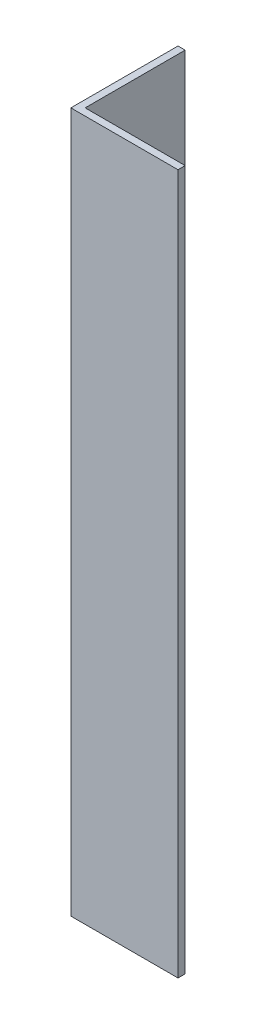
ISO-10303-21;
HEADER;
FILE_DESCRIPTION(('STEP AP214'),'2;1');
FILE_NAME('part.step','',(''),(''),'','','');
FILE_SCHEMA(('AUTOMOTIVE_DESIGN { 1 0 10303 214 1 1 1 1 }'));
ENDSEC;
DATA;
#1=APPLICATION_CONTEXT('core data for automotive mechanical design processes');
#2=APPLICATION_PROTOCOL_DEFINITION('international standard','automotive_design',2000,#1);
#3=PRODUCT_CONTEXT('',#1,'mechanical');
#4=PRODUCT('Part','Part','',(#3));
#5=PRODUCT_RELATED_PRODUCT_CATEGORY('part','',(#4));
#6=PRODUCT_DEFINITION_FORMATION('','',#4);
#7=PRODUCT_DEFINITION_CONTEXT('part definition',#1,'design');
#8=PRODUCT_DEFINITION('design','',#6,#7);
#9=PRODUCT_DEFINITION_SHAPE('','',#8);
#10=(LENGTH_UNIT() NAMED_UNIT(*) SI_UNIT(.MILLI.,.METRE.));
#11=(NAMED_UNIT(*) PLANE_ANGLE_UNIT() SI_UNIT($,.RADIAN.));
#12=(NAMED_UNIT(*) SI_UNIT($,.STERADIAN.) SOLID_ANGLE_UNIT());
#13=UNCERTAINTY_MEASURE_WITH_UNIT(LENGTH_MEASURE(1.E-05),#10,'distance_accuracy_value','');
#14=(GEOMETRIC_REPRESENTATION_CONTEXT(3) GLOBAL_UNCERTAINTY_ASSIGNED_CONTEXT((#13)) GLOBAL_UNIT_ASSIGNED_CONTEXT((#10,
#11,#12)) REPRESENTATION_CONTEXT('',''));
#15=CARTESIAN_POINT('',(0.,0.,0.));
#16=DIRECTION('',(0.,0.,1.));
#17=DIRECTION('',(1.,0.,0.));
#18=AXIS2_PLACEMENT_3D('',#15,#16,#17);
#19=CARTESIAN_POINT('',(15.,98.,0.));
#20=DIRECTION('',(0.,0.,-1.));
#21=DIRECTION('',(-1.,0.,0.));
#22=AXIS2_PLACEMENT_3D('',#19,#20,#21);
#23=PLANE('',#22);
#24=DIRECTION('',(1.,0.,0.));
#25=VECTOR('',#24,1.);
#26=CARTESIAN_POINT('',(15.,0.,0.));
#27=LINE('',#26,#25);
#28=CARTESIAN_POINT('',(0.,0.,0.));
#29=VERTEX_POINT('',#28);
#30=CARTESIAN_POINT('',(15.,0.,0.));
#31=VERTEX_POINT('',#30);
#32=EDGE_CURVE('E121',#29,#31,#27,.T.);
#33=ORIENTED_EDGE('',*,*,#32,.T.);
#34=DIRECTION('',(0.,-1.,0.));
#35=VECTOR('',#34,1.);
#36=CARTESIAN_POINT('',(15.,98.,0.));
#37=LINE('',#36,#35);
#38=CARTESIAN_POINT('',(15.,98.,0.));
#39=VERTEX_POINT('',#38);
#40=EDGE_CURVE('E11',#39,#31,#37,.T.);
#41=ORIENTED_EDGE('',*,*,#40,.F.);
#42=DIRECTION('',(1.,0.,0.));
#43=VECTOR('',#42,1.);
#44=CARTESIAN_POINT('',(15.,98.,0.));
#45=LINE('',#44,#43);
#46=CARTESIAN_POINT('',(0.,98.,0.));
#47=VERTEX_POINT('',#46);
#48=EDGE_CURVE('E131',#47,#39,#45,.T.);
#49=ORIENTED_EDGE('',*,*,#48,.F.);
#50=DIRECTION('',(0.,-1.,0.));
#51=VECTOR('',#50,1.);
#52=CARTESIAN_POINT('',(0.,98.,0.));
#53=LINE('',#52,#51);
#54=EDGE_CURVE('E117',#47,#29,#53,.T.);
#55=ORIENTED_EDGE('',*,*,#54,.T.);
#56=EDGE_LOOP('',(#33,#41,#49,#55));
#57=FACE_BOUND('',#56,.T.);
#58=ADVANCED_FACE('F37',(#57),#23,.F.);
#59=CARTESIAN_POINT('',(15.,98.,-0.999999999999998));
#60=DIRECTION('',(-1.,0.,0.));
#61=DIRECTION('',(0.,0.,1.));
#62=AXIS2_PLACEMENT_3D('',#59,#60,#61);
#63=PLANE('',#62);
#64=DIRECTION('',(0.,0.,-1.));
#65=VECTOR('',#64,1.);
#66=CARTESIAN_POINT('',(15.,0.,-0.999999999999998));
#67=LINE('',#66,#65);
#68=CARTESIAN_POINT('',(15.,0.,-0.999999999999998));
#69=VERTEX_POINT('',#68);
#70=EDGE_CURVE('E124',#31,#69,#67,.T.);
#71=ORIENTED_EDGE('',*,*,#70,.T.);
#72=DIRECTION('',(0.,-1.,0.));
#73=VECTOR('',#72,1.);
#74=CARTESIAN_POINT('',(15.,98.,-0.999999999999998));
#75=LINE('',#74,#73);
#76=CARTESIAN_POINT('',(15.,98.,-0.999999999999998));
#77=VERTEX_POINT('',#76);
#78=EDGE_CURVE('E45',#77,#69,#75,.T.);
#79=ORIENTED_EDGE('',*,*,#78,.F.);
#80=DIRECTION('',(0.,0.,-1.));
#81=VECTOR('',#80,1.);
#82=CARTESIAN_POINT('',(15.,98.,-0.999999999999998));
#83=LINE('',#82,#81);
#84=EDGE_CURVE('E90',#39,#77,#83,.T.);
#85=ORIENTED_EDGE('',*,*,#84,.F.);
#86=ORIENTED_EDGE('',*,*,#40,.T.);
#87=EDGE_LOOP('',(#71,#79,#85,#86));
#88=FACE_BOUND('',#87,.T.);
#89=ADVANCED_FACE('F155',(#88),#63,.F.);
#90=CARTESIAN_POINT('',(1.,98.,-0.999999999999997));
#91=DIRECTION('',(0.,0.,1.));
#92=DIRECTION('',(1.,0.,0.));
#93=AXIS2_PLACEMENT_3D('',#90,#91,#92);
#94=PLANE('',#93);
#95=DIRECTION('',(-1.,0.,0.));
#96=VECTOR('',#95,1.);
#97=CARTESIAN_POINT('',(1.,0.,-0.999999999999997));
#98=LINE('',#97,#96);
#99=CARTESIAN_POINT('',(1.,0.,-0.999999999999997));
#100=VERTEX_POINT('',#99);
#101=EDGE_CURVE('E126',#69,#100,#98,.T.);
#102=ORIENTED_EDGE('',*,*,#101,.T.);
#103=DIRECTION('',(0.,-1.,0.));
#104=VECTOR('',#103,1.);
#105=CARTESIAN_POINT('',(1.,98.,-0.999999999999997));
#106=LINE('',#105,#104);
#107=CARTESIAN_POINT('',(1.,98.,-0.999999999999997));
#108=VERTEX_POINT('',#107);
#109=EDGE_CURVE('E112',#108,#100,#106,.T.);
#110=ORIENTED_EDGE('',*,*,#109,.F.);
#111=DIRECTION('',(-1.,0.,0.));
#112=VECTOR('',#111,1.);
#113=CARTESIAN_POINT('',(1.,98.,-0.999999999999997));
#114=LINE('',#113,#112);
#115=EDGE_CURVE('E103',#77,#108,#114,.T.);
#116=ORIENTED_EDGE('',*,*,#115,.F.);
#117=ORIENTED_EDGE('',*,*,#78,.T.);
#118=EDGE_LOOP('',(#102,#110,#116,#117));
#119=FACE_BOUND('',#118,.T.);
#120=ADVANCED_FACE('F137',(#119),#94,.F.);
#121=CARTESIAN_POINT('',(0.999999999999998,98.,-15.));
#122=DIRECTION('',(-1.,0.,0.));
#123=DIRECTION('',(0.,0.,1.));
#124=AXIS2_PLACEMENT_3D('',#121,#122,#123);
#125=PLANE('',#124);
#126=DIRECTION('',(0.,0.,-1.));
#127=VECTOR('',#126,1.);
#128=CARTESIAN_POINT('',(0.999999999999998,0.,-15.));
#129=LINE('',#128,#127);
#130=CARTESIAN_POINT('',(0.999999999999998,0.,-15.));
#131=VERTEX_POINT('',#130);
#132=EDGE_CURVE('E111',#100,#131,#129,.T.);
#133=ORIENTED_EDGE('',*,*,#132,.T.);
#134=DIRECTION('',(0.,-1.,0.));
#135=VECTOR('',#134,1.);
#136=CARTESIAN_POINT('',(0.999999999999998,98.,-15.));
#137=LINE('',#136,#135);
#138=CARTESIAN_POINT('',(0.999999999999998,98.,-15.));
#139=VERTEX_POINT('',#138);
#140=EDGE_CURVE('E108',#139,#131,#137,.T.);
#141=ORIENTED_EDGE('',*,*,#140,.F.);
#142=DIRECTION('',(0.,0.,-1.));
#143=VECTOR('',#142,1.);
#144=CARTESIAN_POINT('',(0.999999999999998,98.,-15.));
#145=LINE('',#144,#143);
#146=EDGE_CURVE('E97',#108,#139,#145,.T.);
#147=ORIENTED_EDGE('',*,*,#146,.F.);
#148=ORIENTED_EDGE('',*,*,#109,.T.);
#149=EDGE_LOOP('',(#133,#141,#147,#148));
#150=FACE_BOUND('',#149,.T.);
#151=ADVANCED_FACE('F109',(#150),#125,.F.);
#152=CARTESIAN_POINT('',(0.,98.,-15.));
#153=DIRECTION('',(0.,0.,1.));
#154=DIRECTION('',(1.,0.,0.));
#155=AXIS2_PLACEMENT_3D('',#152,#153,#154);
#156=PLANE('',#155);
#157=DIRECTION('',(-1.,0.,0.));
#158=VECTOR('',#157,1.);
#159=CARTESIAN_POINT('',(0.,0.,-15.));
#160=LINE('',#159,#158);
#161=CARTESIAN_POINT('',(0.,0.,-15.));
#162=VERTEX_POINT('',#161);
#163=EDGE_CURVE('E76',#131,#162,#160,.T.);
#164=ORIENTED_EDGE('',*,*,#163,.T.);
#165=DIRECTION('',(0.,-1.,0.));
#166=VECTOR('',#165,1.);
#167=CARTESIAN_POINT('',(0.,98.,-15.));
#168=LINE('',#167,#166);
#169=CARTESIAN_POINT('',(0.,98.,-15.));
#170=VERTEX_POINT('',#169);
#171=EDGE_CURVE('E113',#170,#162,#168,.T.);
#172=ORIENTED_EDGE('',*,*,#171,.F.);
#173=DIRECTION('',(-1.,0.,0.));
#174=VECTOR('',#173,1.);
#175=CARTESIAN_POINT('',(0.,98.,-15.));
#176=LINE('',#175,#174);
#177=EDGE_CURVE('E101',#139,#170,#176,.T.);
#178=ORIENTED_EDGE('',*,*,#177,.F.);
#179=ORIENTED_EDGE('',*,*,#140,.T.);
#180=EDGE_LOOP('',(#164,#172,#178,#179));
#181=FACE_BOUND('',#180,.T.);
#182=ADVANCED_FACE('F115',(#181),#156,.F.);
#183=CARTESIAN_POINT('',(0.,98.,0.));
#184=DIRECTION('',(1.,0.,0.));
#185=DIRECTION('',(0.,0.,-1.));
#186=AXIS2_PLACEMENT_3D('',#183,#184,#185);
#187=PLANE('',#186);
#188=DIRECTION('',(0.,0.,1.));
#189=VECTOR('',#188,1.);
#190=CARTESIAN_POINT('',(0.,0.,0.));
#191=LINE('',#190,#189);
#192=EDGE_CURVE('E82',#162,#29,#191,.T.);
#193=ORIENTED_EDGE('',*,*,#192,.T.);
#194=ORIENTED_EDGE('',*,*,#54,.F.);
#195=DIRECTION('',(0.,0.,1.));
#196=VECTOR('',#195,1.);
#197=CARTESIAN_POINT('',(0.,98.,0.));
#198=LINE('',#197,#196);
#199=EDGE_CURVE('E53',#170,#47,#198,.T.);
#200=ORIENTED_EDGE('',*,*,#199,.F.);
#201=ORIENTED_EDGE('',*,*,#171,.T.);
#202=EDGE_LOOP('',(#193,#194,#200,#201));
#203=FACE_BOUND('',#202,.T.);
#204=ADVANCED_FACE('F144',(#203),#187,.F.);
#205=CARTESIAN_POINT('',(0.,98.,0.));
#206=DIRECTION('',(0.,-1.,0.));
#207=DIRECTION('',(0.,0.,-1.));
#208=AXIS2_PLACEMENT_3D('',#205,#206,#207);
#209=PLANE('',#208);
#210=ORIENTED_EDGE('',*,*,#48,.T.);
#211=ORIENTED_EDGE('',*,*,#84,.T.);
#212=ORIENTED_EDGE('',*,*,#115,.T.);
#213=ORIENTED_EDGE('',*,*,#146,.T.);
#214=ORIENTED_EDGE('',*,*,#177,.T.);
#215=ORIENTED_EDGE('',*,*,#199,.T.);
#216=EDGE_LOOP('',(#210,#211,#212,#213,#214,#215));
#217=FACE_BOUND('',#216,.T.);
#218=ADVANCED_FACE('F99',(#217),#209,.F.);
#219=CARTESIAN_POINT('',(0.,0.,0.));
#220=DIRECTION('',(0.,-1.,0.));
#221=DIRECTION('',(0.,0.,-1.));
#222=AXIS2_PLACEMENT_3D('',#219,#220,#221);
#223=PLANE('',#222);
#224=ORIENTED_EDGE('',*,*,#32,.F.);
#225=ORIENTED_EDGE('',*,*,#192,.F.);
#226=ORIENTED_EDGE('',*,*,#163,.F.);
#227=ORIENTED_EDGE('',*,*,#132,.F.);
#228=ORIENTED_EDGE('',*,*,#101,.F.);
#229=ORIENTED_EDGE('',*,*,#70,.F.);
#230=EDGE_LOOP('',(#224,#225,#226,#227,#228,#229));
#231=FACE_BOUND('',#230,.T.);
#232=ADVANCED_FACE('F140',(#231),#223,.T.);
#233=CLOSED_SHELL('',(#58,#89,#120,#151,#182,#204,#218,#232));
#234=MANIFOLD_SOLID_BREP('B2',#233);
#235=ADVANCED_BREP_SHAPE_REPRESENTATION('',(#18,#234),#14);
#236=SHAPE_DEFINITION_REPRESENTATION(#9,#235);
ENDSEC;
END-ISO-10303-21;
